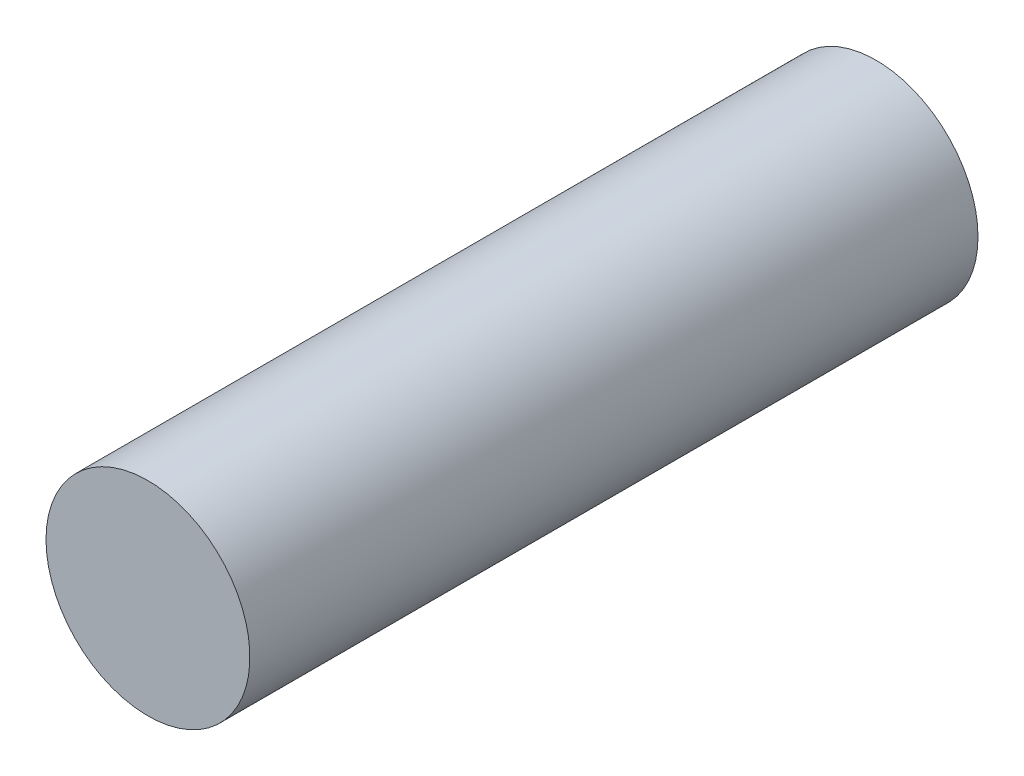
ISO-10303-21;
HEADER;
FILE_DESCRIPTION(('STEP AP214'),'2;1');
FILE_NAME('part.step','',(''),(''),'','','');
FILE_SCHEMA(('AUTOMOTIVE_DESIGN { 1 0 10303 214 1 1 1 1 }'));
ENDSEC;
DATA;
#1=APPLICATION_CONTEXT('core data for automotive mechanical design processes');
#2=APPLICATION_PROTOCOL_DEFINITION('international standard','automotive_design',2000,#1);
#3=PRODUCT_CONTEXT('',#1,'mechanical');
#4=PRODUCT('Part','Part','',(#3));
#5=PRODUCT_RELATED_PRODUCT_CATEGORY('part','',(#4));
#6=PRODUCT_DEFINITION_FORMATION('','',#4);
#7=PRODUCT_DEFINITION_CONTEXT('part definition',#1,'design');
#8=PRODUCT_DEFINITION('design','',#6,#7);
#9=PRODUCT_DEFINITION_SHAPE('','',#8);
#10=(LENGTH_UNIT() NAMED_UNIT(*) SI_UNIT(.MILLI.,.METRE.));
#11=(NAMED_UNIT(*) PLANE_ANGLE_UNIT() SI_UNIT($,.RADIAN.));
#12=(NAMED_UNIT(*) SI_UNIT($,.STERADIAN.) SOLID_ANGLE_UNIT());
#13=UNCERTAINTY_MEASURE_WITH_UNIT(LENGTH_MEASURE(1.E-05),#10,'distance_accuracy_value','');
#14=(GEOMETRIC_REPRESENTATION_CONTEXT(3) GLOBAL_UNCERTAINTY_ASSIGNED_CONTEXT((#13)) GLOBAL_UNIT_ASSIGNED_CONTEXT((#10,
#11,#12)) REPRESENTATION_CONTEXT('',''));
#15=CARTESIAN_POINT('',(0.,0.,0.));
#16=DIRECTION('',(0.,0.,1.));
#17=DIRECTION('',(1.,0.,0.));
#18=AXIS2_PLACEMENT_3D('',#15,#16,#17);
#19=CARTESIAN_POINT('',(0.,0.,8.));
#20=DIRECTION('',(0.,0.,-1.));
#21=DIRECTION('',(-1.,0.,0.));
#22=AXIS2_PLACEMENT_3D('',#19,#20,#21);
#23=CYLINDRICAL_SURFACE('',#22,3.5);
#24=CARTESIAN_POINT('',(0.,0.,0.));
#25=DIRECTION('',(0.,0.,1.));
#26=DIRECTION('',(1.,0.,0.));
#27=AXIS2_PLACEMENT_3D('',#24,#25,#26);
#28=CIRCLE('',#27,3.5);
#29=CARTESIAN_POINT('',(3.5,0.,0.));
#30=VERTEX_POINT('',#29);
#31=EDGE_CURVE('E11',#30,#30,#28,.T.);
#32=ORIENTED_EDGE('',*,*,#31,.T.);
#33=EDGE_LOOP('',(#32));
#34=FACE_BOUND('',#33,.T.);
#35=CARTESIAN_POINT('',(0.,0.,25.));
#36=DIRECTION('',(0.,0.,-1.));
#37=DIRECTION('',(-1.,0.,0.));
#38=AXIS2_PLACEMENT_3D('',#35,#36,#37);
#39=CIRCLE('',#38,3.5);
#40=CARTESIAN_POINT('',(-3.5,0.,25.));
#41=VERTEX_POINT('',#40);
#42=EDGE_CURVE('E75',#41,#41,#39,.T.);
#43=ORIENTED_EDGE('',*,*,#42,.T.);
#44=EDGE_LOOP('',(#43));
#45=FACE_BOUND('',#44,.T.);
#46=ADVANCED_FACE('F35',(#34,#45),#23,.T.);
#47=CARTESIAN_POINT('',(0.,0.,0.));
#48=DIRECTION('',(0.,0.,1.));
#49=DIRECTION('',(1.,0.,0.));
#50=AXIS2_PLACEMENT_3D('',#47,#48,#49);
#51=PLANE('',#50);
#52=ORIENTED_EDGE('',*,*,#31,.F.);
#53=EDGE_LOOP('',(#52));
#54=FACE_BOUND('',#53,.T.);
#55=CARTESIAN_POINT('',(0.,0.,0.));
#56=DIRECTION('',(0.,0.,1.));
#57=DIRECTION('',(1.,0.,0.));
#58=AXIS2_PLACEMENT_3D('',#55,#56,#57);
#59=CIRCLE('',#58,1.75);
#60=CARTESIAN_POINT('',(1.23743686707646,-1.23743686707646,0.));
#61=VERTEX_POINT('',#60);
#62=CARTESIAN_POINT('',(-1.23743686707646,-1.23743686707646,0.));
#63=VERTEX_POINT('',#62);
#64=EDGE_CURVE('E49',#61,#63,#59,.T.);
#65=ORIENTED_EDGE('',*,*,#64,.T.);
#66=DIRECTION('',(1.,0.,0.));
#67=VECTOR('',#66,1.);
#68=CARTESIAN_POINT('',(-1.23743686707646,-1.23743686707646,0.));
#69=LINE('',#68,#67);
#70=EDGE_CURVE('E70',#63,#61,#69,.T.);
#71=ORIENTED_EDGE('',*,*,#70,.T.);
#72=EDGE_LOOP('',(#65,#71));
#73=FACE_BOUND('',#72,.T.);
#74=ADVANCED_FACE('F79',(#54,#73),#51,.F.);
#75=CARTESIAN_POINT('',(0.,0.,8.));
#76=DIRECTION('',(0.,0.,-1.));
#77=DIRECTION('',(-1.,0.,0.));
#78=AXIS2_PLACEMENT_3D('',#75,#76,#77);
#79=CYLINDRICAL_SURFACE('',#78,1.75);
#80=ORIENTED_EDGE('',*,*,#64,.F.);
#81=DIRECTION('',(0.,0.,-1.));
#82=VECTOR('',#81,1.);
#83=CARTESIAN_POINT('',(1.23743686707646,-1.23743686707646,8.));
#84=LINE('',#83,#82);
#85=CARTESIAN_POINT('',(1.23743686707646,-1.23743686707646,8.));
#86=VERTEX_POINT('',#85);
#87=EDGE_CURVE('E66',#86,#61,#84,.T.);
#88=ORIENTED_EDGE('',*,*,#87,.F.);
#89=CARTESIAN_POINT('',(0.,0.,8.));
#90=DIRECTION('',(0.,0.,1.));
#91=DIRECTION('',(1.,0.,0.));
#92=AXIS2_PLACEMENT_3D('',#89,#90,#91);
#93=CIRCLE('',#92,1.75);
#94=CARTESIAN_POINT('',(-1.23743686707646,-1.23743686707646,8.));
#95=VERTEX_POINT('',#94);
#96=EDGE_CURVE('E57',#86,#95,#93,.T.);
#97=ORIENTED_EDGE('',*,*,#96,.T.);
#98=DIRECTION('',(0.,0.,-1.));
#99=VECTOR('',#98,1.);
#100=CARTESIAN_POINT('',(-1.23743686707646,-1.23743686707646,8.));
#101=LINE('',#100,#99);
#102=EDGE_CURVE('E42',#95,#63,#101,.T.);
#103=ORIENTED_EDGE('',*,*,#102,.T.);
#104=EDGE_LOOP('',(#80,#88,#97,#103));
#105=FACE_BOUND('',#104,.T.);
#106=ADVANCED_FACE('F71',(#105),#79,.F.);
#107=CARTESIAN_POINT('',(-1.23743686707646,-1.23743686707646,8.));
#108=DIRECTION('',(0.,1.,0.));
#109=DIRECTION('',(0.,0.,1.));
#110=AXIS2_PLACEMENT_3D('',#107,#108,#109);
#111=PLANE('',#110);
#112=ORIENTED_EDGE('',*,*,#70,.F.);
#113=ORIENTED_EDGE('',*,*,#102,.F.);
#114=DIRECTION('',(1.,0.,0.));
#115=VECTOR('',#114,1.);
#116=CARTESIAN_POINT('',(-1.23743686707646,-1.23743686707646,8.));
#117=LINE('',#116,#115);
#118=EDGE_CURVE('E62',#95,#86,#117,.T.);
#119=ORIENTED_EDGE('',*,*,#118,.T.);
#120=ORIENTED_EDGE('',*,*,#87,.T.);
#121=EDGE_LOOP('',(#112,#113,#119,#120));
#122=FACE_BOUND('',#121,.T.);
#123=ADVANCED_FACE('F68',(#122),#111,.T.);
#124=CARTESIAN_POINT('',(0.,0.,8.));
#125=DIRECTION('',(0.,0.,1.));
#126=DIRECTION('',(1.,0.,0.));
#127=AXIS2_PLACEMENT_3D('',#124,#125,#126);
#128=PLANE('',#127);
#129=ORIENTED_EDGE('',*,*,#96,.F.);
#130=ORIENTED_EDGE('',*,*,#118,.F.);
#131=EDGE_LOOP('',(#129,#130));
#132=FACE_BOUND('',#131,.T.);
#133=ADVANCED_FACE('F64',(#132),#128,.F.);
#134=CARTESIAN_POINT('',(0.,0.,25.));
#135=DIRECTION('',(0.,0.,-1.));
#136=DIRECTION('',(-1.,0.,0.));
#137=AXIS2_PLACEMENT_3D('',#134,#135,#136);
#138=PLANE('',#137);
#139=ORIENTED_EDGE('',*,*,#42,.F.);
#140=EDGE_LOOP('',(#139));
#141=FACE_BOUND('',#140,.T.);
#142=ADVANCED_FACE('F94',(#141),#138,.F.);
#143=CLOSED_SHELL('',(#46,#74,#106,#123,#133,#142));
#144=MANIFOLD_SOLID_BREP('B2',#143);
#145=ADVANCED_BREP_SHAPE_REPRESENTATION('',(#18,#144),#14);
#146=SHAPE_DEFINITION_REPRESENTATION(#9,#145);
ENDSEC;
END-ISO-10303-21;
